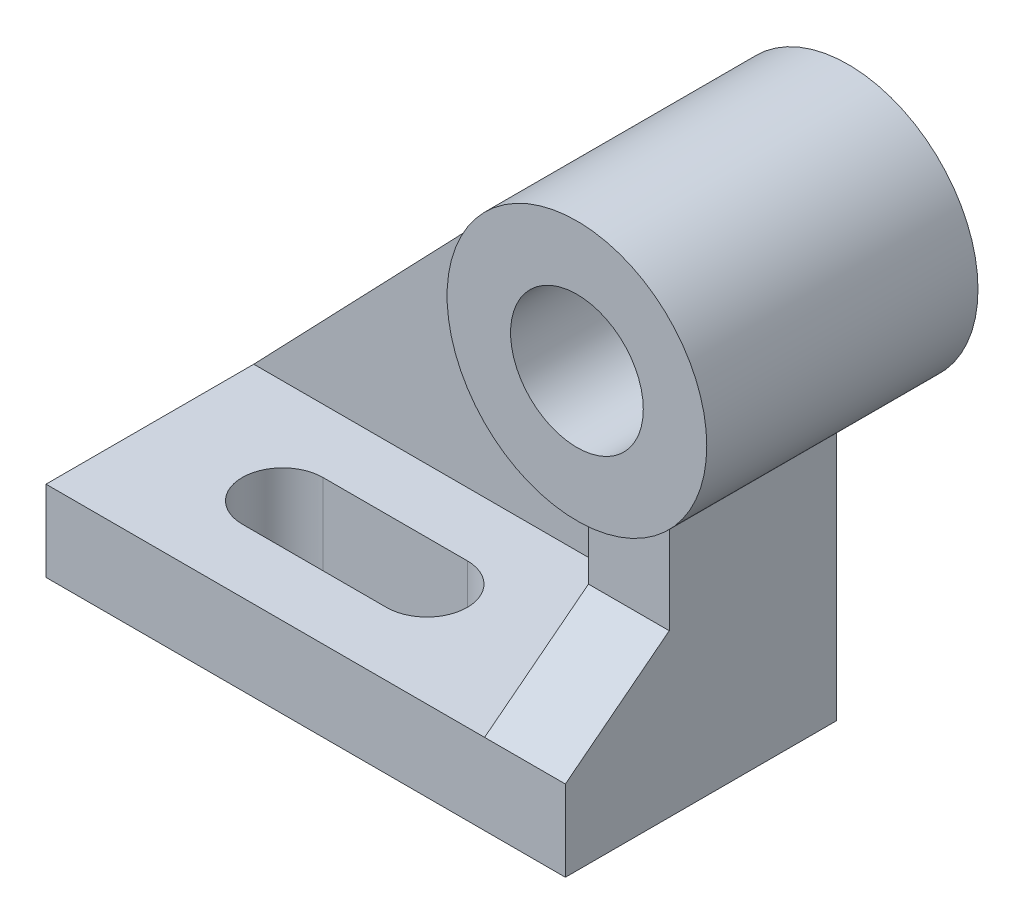
ISO-10303-21;
HEADER;
FILE_DESCRIPTION(('STEP AP214'),'2;1');
FILE_NAME('part.step','',(''),(''),'','','');
FILE_SCHEMA(('AUTOMOTIVE_DESIGN { 1 0 10303 214 1 1 1 1 }'));
ENDSEC;
DATA;
#1=APPLICATION_CONTEXT('core data for automotive mechanical design processes');
#2=APPLICATION_PROTOCOL_DEFINITION('international standard','automotive_design',2000,#1);
#3=PRODUCT_CONTEXT('',#1,'mechanical');
#4=PRODUCT('Part','Part','',(#3));
#5=PRODUCT_RELATED_PRODUCT_CATEGORY('part','',(#4));
#6=PRODUCT_DEFINITION_FORMATION('','',#4);
#7=PRODUCT_DEFINITION_CONTEXT('part definition',#1,'design');
#8=PRODUCT_DEFINITION('design','',#6,#7);
#9=PRODUCT_DEFINITION_SHAPE('','',#8);
#10=(LENGTH_UNIT() NAMED_UNIT(*) SI_UNIT(.MILLI.,.METRE.));
#11=(NAMED_UNIT(*) PLANE_ANGLE_UNIT() SI_UNIT($,.RADIAN.));
#12=(NAMED_UNIT(*) SI_UNIT($,.STERADIAN.) SOLID_ANGLE_UNIT());
#13=UNCERTAINTY_MEASURE_WITH_UNIT(LENGTH_MEASURE(1.E-05),#10,'distance_accuracy_value','');
#14=(GEOMETRIC_REPRESENTATION_CONTEXT(3) GLOBAL_UNCERTAINTY_ASSIGNED_CONTEXT((#13)) GLOBAL_UNIT_ASSIGNED_CONTEXT((#10,
#11,#12)) REPRESENTATION_CONTEXT('',''));
#15=CARTESIAN_POINT('',(0.,0.,0.));
#16=DIRECTION('',(0.,0.,1.));
#17=DIRECTION('',(1.,0.,0.));
#18=AXIS2_PLACEMENT_3D('',#15,#16,#17);
#19=CARTESIAN_POINT('',(0.,-54.,56.));
#20=DIRECTION('',(0.,-1.,0.));
#21=DIRECTION('',(1.,0.,0.));
#22=AXIS2_PLACEMENT_3D('',#19,#20,#21);
#23=PLANE('',#22);
#24=DIRECTION('',(1.,0.,0.));
#25=VECTOR('',#24,1.);
#26=CARTESIAN_POINT('',(0.,-54.,45.));
#27=LINE('',#26,#25);
#28=CARTESIAN_POINT('',(-60.,-54.,45.));
#29=VERTEX_POINT('',#28);
#30=CARTESIAN_POINT('',(-35.,-54.,45.));
#31=VERTEX_POINT('',#30);
#32=EDGE_CURVE('E144',#29,#31,#27,.T.);
#33=ORIENTED_EDGE('',*,*,#32,.F.);
#34=CARTESIAN_POINT('',(-60.,-54.,38.));
#35=DIRECTION('',(0.,-1.,0.));
#36=DIRECTION('',(1.,0.,0.));
#37=AXIS2_PLACEMENT_3D('',#34,#35,#36);
#38=CIRCLE('',#37,7.);
#39=CARTESIAN_POINT('',(-60.,-54.,31.));
#40=VERTEX_POINT('',#39);
#41=EDGE_CURVE('E137',#29,#40,#38,.T.);
#42=ORIENTED_EDGE('',*,*,#41,.T.);
#43=DIRECTION('',(1.,0.,0.));
#44=VECTOR('',#43,1.);
#45=CARTESIAN_POINT('',(0.,-54.,31.));
#46=LINE('',#45,#44);
#47=CARTESIAN_POINT('',(-35.,-54.,31.));
#48=VERTEX_POINT('',#47);
#49=EDGE_CURVE('E126',#40,#48,#46,.T.);
#50=ORIENTED_EDGE('',*,*,#49,.T.);
#51=CARTESIAN_POINT('',(-35.,-54.,38.));
#52=DIRECTION('',(0.,-1.,0.));
#53=DIRECTION('',(1.,0.,0.));
#54=AXIS2_PLACEMENT_3D('',#51,#52,#53);
#55=CIRCLE('',#54,7.);
#56=EDGE_CURVE('E131',#48,#31,#55,.T.);
#57=ORIENTED_EDGE('',*,*,#56,.T.);
#58=EDGE_LOOP('',(#33,#42,#50,#57));
#59=FACE_BOUND('',#58,.T.);
#60=DIRECTION('',(-1.,0.,0.));
#61=VECTOR('',#60,1.);
#62=CARTESIAN_POINT('',(0.,-54.,56.));
#63=LINE('',#62,#61);
#64=CARTESIAN_POINT('',(-6.99999999999999,-54.,56.));
#65=VERTEX_POINT('',#64);
#66=CARTESIAN_POINT('',(-83.,-54.,56.));
#67=VERTEX_POINT('',#66);
#68=EDGE_CURVE('E183',#65,#67,#63,.T.);
#69=ORIENTED_EDGE('',*,*,#68,.F.);
#70=DIRECTION('',(0.,0.,-1.));
#71=VECTOR('',#70,1.);
#72=CARTESIAN_POINT('',(-6.99999999999999,-54.,38.));
#73=LINE('',#72,#71);
#74=CARTESIAN_POINT('',(-6.99999999999999,-54.,20.));
#75=VERTEX_POINT('',#74);
#76=EDGE_CURVE('E168',#65,#75,#73,.T.);
#77=ORIENTED_EDGE('',*,*,#76,.T.);
#78=DIRECTION('',(1.,0.,0.));
#79=VECTOR('',#78,1.);
#80=CARTESIAN_POINT('',(-6.99999999999999,-54.,20.));
#81=LINE('',#80,#79);
#82=CARTESIAN_POINT('',(-83.,-54.,20.));
#83=VERTEX_POINT('',#82);
#84=EDGE_CURVE('E207',#83,#75,#81,.T.);
#85=ORIENTED_EDGE('',*,*,#84,.F.);
#86=DIRECTION('',(0.,0.,-1.));
#87=VECTOR('',#86,1.);
#88=CARTESIAN_POINT('',(-83.,-54.,56.));
#89=LINE('',#88,#87);
#90=EDGE_CURVE('E187',#67,#83,#89,.T.);
#91=ORIENTED_EDGE('',*,*,#90,.F.);
#92=EDGE_LOOP('',(#69,#77,#85,#91));
#93=FACE_BOUND('',#92,.T.);
#94=ADVANCED_FACE('F35',(#59,#93),#23,.F.);
#95=CARTESIAN_POINT('',(0.,0.,47.));
#96=DIRECTION('',(0.,0.,-1.));
#97=DIRECTION('',(-1.,0.,0.));
#98=AXIS2_PLACEMENT_3D('',#95,#96,#97);
#99=CYLINDRICAL_SURFACE('',#98,22.5);
#100=CARTESIAN_POINT('',(0.,0.,0.));
#101=DIRECTION('',(0.,0.,1.));
#102=DIRECTION('',(1.,0.,0.));
#103=AXIS2_PLACEMENT_3D('',#100,#101,#102);
#104=CIRCLE('',#103,22.5);
#105=CARTESIAN_POINT('',(22.5,0.,0.));
#106=VERTEX_POINT('',#105);
#107=EDGE_CURVE('E224',#106,#106,#104,.T.);
#108=ORIENTED_EDGE('',*,*,#107,.T.);
#109=EDGE_LOOP('',(#108));
#110=FACE_BOUND('',#109,.T.);
#111=CARTESIAN_POINT('',(0.,0.,47.));
#112=DIRECTION('',(0.,0.,1.));
#113=DIRECTION('',(1.,0.,0.));
#114=AXIS2_PLACEMENT_3D('',#111,#112,#113);
#115=CIRCLE('',#114,22.5);
#116=CARTESIAN_POINT('',(22.5,0.,47.));
#117=VERTEX_POINT('',#116);
#118=EDGE_CURVE('E227',#117,#117,#115,.T.);
#119=ORIENTED_EDGE('',*,*,#118,.F.);
#120=EDGE_LOOP('',(#119));
#121=FACE_BOUND('',#120,.T.);
#122=DIRECTION('',(0.,0.,-1.));
#123=VECTOR('',#122,1.);
#124=CARTESIAN_POINT('',(-6.99999999999999,-21.3834047803431,38.));
#125=LINE('',#124,#123);
#126=CARTESIAN_POINT('',(-6.99999999999999,-21.3834047803431,38.));
#127=VERTEX_POINT('',#126);
#128=CARTESIAN_POINT('',(-6.99999999999999,-21.3834047803431,20.));
#129=VERTEX_POINT('',#128);
#130=EDGE_CURVE('E170',#127,#129,#125,.T.);
#131=ORIENTED_EDGE('',*,*,#130,.F.);
#132=CARTESIAN_POINT('',(0.,0.,38.));
#133=DIRECTION('',(0.,0.,-1.));
#134=DIRECTION('',(-1.,0.,0.));
#135=AXIS2_PLACEMENT_3D('',#132,#133,#134);
#136=CIRCLE('',#135,22.5);
#137=CARTESIAN_POINT('',(7.00000000000001,-21.3834047803431,38.));
#138=VERTEX_POINT('',#137);
#139=EDGE_CURVE('E158',#138,#127,#136,.T.);
#140=ORIENTED_EDGE('',*,*,#139,.F.);
#141=DIRECTION('',(0.,0.,-1.));
#142=VECTOR('',#141,1.);
#143=CARTESIAN_POINT('',(7.00000000000001,-21.3834047803431,38.));
#144=LINE('',#143,#142);
#145=CARTESIAN_POINT('',(7.00000000000001,-21.3834047803431,9.));
#146=VERTEX_POINT('',#145);
#147=EDGE_CURVE('E165',#138,#146,#144,.T.);
#148=ORIENTED_EDGE('',*,*,#147,.T.);
#149=CARTESIAN_POINT('',(0.,0.,9.));
#150=DIRECTION('',(0.,0.,-1.));
#151=DIRECTION('',(1.,0.,0.));
#152=AXIS2_PLACEMENT_3D('',#149,#150,#151);
#153=CIRCLE('',#152,22.5);
#154=CARTESIAN_POINT('',(-16.2346998602256,15.5783349703475,9.));
#155=VERTEX_POINT('',#154);
#156=EDGE_CURVE('E211',#146,#155,#153,.T.);
#157=ORIENTED_EDGE('',*,*,#156,.T.);
#158=DIRECTION('',(0.,0.,-1.));
#159=VECTOR('',#158,1.);
#160=CARTESIAN_POINT('',(-16.2347042764132,15.5783303680918,20.));
#161=LINE('',#160,#159);
#162=CARTESIAN_POINT('',(-16.2346998602259,15.5783349703478,20.));
#163=VERTEX_POINT('',#162);
#164=EDGE_CURVE('E216',#163,#155,#161,.T.);
#165=ORIENTED_EDGE('',*,*,#164,.F.);
#166=CARTESIAN_POINT('',(0.,0.,20.));
#167=DIRECTION('',(0.,0.,-1.));
#168=DIRECTION('',(1.,0.,0.));
#169=AXIS2_PLACEMENT_3D('',#166,#167,#168);
#170=CIRCLE('',#169,22.5);
#171=EDGE_CURVE('E206',#129,#163,#170,.T.);
#172=ORIENTED_EDGE('',*,*,#171,.F.);
#173=EDGE_LOOP('',(#131,#140,#148,#157,#165,#172));
#174=FACE_BOUND('',#173,.T.);
#175=ADVANCED_FACE('F37',(#110,#121,#174),#99,.T.);
#176=CARTESIAN_POINT('',(0.,0.,47.));
#177=DIRECTION('',(0.,0.,1.));
#178=DIRECTION('',(1.,0.,0.));
#179=AXIS2_PLACEMENT_3D('',#176,#177,#178);
#180=PLANE('',#179);
#181=ORIENTED_EDGE('',*,*,#118,.T.);
#182=EDGE_LOOP('',(#181));
#183=FACE_BOUND('',#182,.T.);
#184=CARTESIAN_POINT('',(0.,0.,47.));
#185=DIRECTION('',(0.,0.,1.));
#186=DIRECTION('',(1.,0.,0.));
#187=AXIS2_PLACEMENT_3D('',#184,#185,#186);
#188=CIRCLE('',#187,11.5);
#189=CARTESIAN_POINT('',(11.5,0.,47.));
#190=VERTEX_POINT('',#189);
#191=EDGE_CURVE('E221',#190,#190,#188,.T.);
#192=ORIENTED_EDGE('',*,*,#191,.F.);
#193=EDGE_LOOP('',(#192));
#194=FACE_BOUND('',#193,.T.);
#195=ADVANCED_FACE('F274',(#183,#194),#180,.T.);
#196=CARTESIAN_POINT('',(0.,0.,0.));
#197=DIRECTION('',(0.,0.,1.));
#198=DIRECTION('',(1.,0.,0.));
#199=AXIS2_PLACEMENT_3D('',#196,#197,#198);
#200=PLANE('',#199);
#201=ORIENTED_EDGE('',*,*,#107,.F.);
#202=EDGE_LOOP('',(#201));
#203=FACE_BOUND('',#202,.T.);
#204=CARTESIAN_POINT('',(0.,0.,0.));
#205=DIRECTION('',(0.,0.,1.));
#206=DIRECTION('',(1.,0.,0.));
#207=AXIS2_PLACEMENT_3D('',#204,#205,#206);
#208=CIRCLE('',#207,11.5);
#209=CARTESIAN_POINT('',(11.5,0.,0.));
#210=VERTEX_POINT('',#209);
#211=EDGE_CURVE('E219',#210,#210,#208,.T.);
#212=ORIENTED_EDGE('',*,*,#211,.T.);
#213=EDGE_LOOP('',(#212));
#214=FACE_BOUND('',#213,.T.);
#215=ADVANCED_FACE('F305',(#203,#214),#200,.F.);
#216=CARTESIAN_POINT('',(0.,0.,47.));
#217=DIRECTION('',(0.,0.,-1.));
#218=DIRECTION('',(-1.,0.,0.));
#219=AXIS2_PLACEMENT_3D('',#216,#217,#218);
#220=CYLINDRICAL_SURFACE('',#219,11.5);
#221=ORIENTED_EDGE('',*,*,#191,.T.);
#222=EDGE_LOOP('',(#221));
#223=FACE_BOUND('',#222,.T.);
#224=ORIENTED_EDGE('',*,*,#211,.F.);
#225=EDGE_LOOP('',(#224));
#226=FACE_BOUND('',#225,.T.);
#227=ADVANCED_FACE('F301',(#223,#226),#220,.F.);
#228=CARTESIAN_POINT('',(-83.,-54.,20.));
#229=DIRECTION('',(0.721542216010055,-0.692370443126582,0.));
#230=DIRECTION('',(0.692370443126582,0.721542216010055,0.));
#231=AXIS2_PLACEMENT_3D('',#228,#229,#230);
#232=PLANE('',#231);
#233=DIRECTION('',(-0.692370443126582,-0.721542216010055,0.));
#234=VECTOR('',#233,1.);
#235=CARTESIAN_POINT('',(-83.,-54.,9.));
#236=LINE('',#235,#234);
#237=CARTESIAN_POINT('',(-83.,-54.,9.));
#238=VERTEX_POINT('',#237);
#239=EDGE_CURVE('E213',#155,#238,#236,.T.);
#240=ORIENTED_EDGE('',*,*,#239,.T.);
#241=DIRECTION('',(0.,0.,-1.));
#242=VECTOR('',#241,1.);
#243=CARTESIAN_POINT('',(-83.,-54.,20.));
#244=LINE('',#243,#242);
#245=EDGE_CURVE('E220',#83,#238,#244,.T.);
#246=ORIENTED_EDGE('',*,*,#245,.F.);
#247=DIRECTION('',(-0.692370443126582,-0.721542216010055,0.));
#248=VECTOR('',#247,1.);
#249=CARTESIAN_POINT('',(-83.,-54.,20.));
#250=LINE('',#249,#248);
#251=EDGE_CURVE('E210',#163,#83,#250,.T.);
#252=ORIENTED_EDGE('',*,*,#251,.F.);
#253=ORIENTED_EDGE('',*,*,#164,.T.);
#254=EDGE_LOOP('',(#240,#246,#252,#253));
#255=FACE_BOUND('',#254,.T.);
#256=ADVANCED_FACE('F294',(#255),#232,.F.);
#257=CARTESIAN_POINT('',(0.,0.,20.));
#258=DIRECTION('',(0.,0.,1.));
#259=DIRECTION('',(1.,0.,0.));
#260=AXIS2_PLACEMENT_3D('',#257,#258,#259);
#261=PLANE('',#260);
#262=ORIENTED_EDGE('',*,*,#84,.T.);
#263=DIRECTION('',(0.,1.,0.));
#264=VECTOR('',#263,1.);
#265=CARTESIAN_POINT('',(-6.99999999999999,-54.,20.));
#266=LINE('',#265,#264);
#267=EDGE_CURVE('E203',#75,#129,#266,.T.);
#268=ORIENTED_EDGE('',*,*,#267,.T.);
#269=ORIENTED_EDGE('',*,*,#171,.T.);
#270=ORIENTED_EDGE('',*,*,#251,.T.);
#271=EDGE_LOOP('',(#262,#268,#269,#270));
#272=FACE_BOUND('',#271,.T.);
#273=ADVANCED_FACE('F291',(#272),#261,.T.);
#274=CARTESIAN_POINT('',(0.,0.,9.));
#275=DIRECTION('',(0.,0.,1.));
#276=DIRECTION('',(1.,0.,0.));
#277=AXIS2_PLACEMENT_3D('',#274,#275,#276);
#278=PLANE('',#277);
#279=ORIENTED_EDGE('',*,*,#156,.F.);
#280=DIRECTION('',(0.,1.,0.));
#281=VECTOR('',#280,1.);
#282=CARTESIAN_POINT('',(7.00000000000001,0.,9.));
#283=LINE('',#282,#281);
#284=CARTESIAN_POINT('',(7.00000000000001,-68.,9.));
#285=VERTEX_POINT('',#284);
#286=EDGE_CURVE('E178',#285,#146,#283,.T.);
#287=ORIENTED_EDGE('',*,*,#286,.F.);
#288=DIRECTION('',(-1.,0.,0.));
#289=VECTOR('',#288,1.);
#290=CARTESIAN_POINT('',(0.,-68.,9.));
#291=LINE('',#290,#289);
#292=CARTESIAN_POINT('',(-83.,-68.,9.));
#293=VERTEX_POINT('',#292);
#294=EDGE_CURVE('E190',#285,#293,#291,.T.);
#295=ORIENTED_EDGE('',*,*,#294,.T.);
#296=DIRECTION('',(0.,1.,0.));
#297=VECTOR('',#296,1.);
#298=CARTESIAN_POINT('',(-83.,0.,9.));
#299=LINE('',#298,#297);
#300=EDGE_CURVE('E173',#293,#238,#299,.T.);
#301=ORIENTED_EDGE('',*,*,#300,.T.);
#302=ORIENTED_EDGE('',*,*,#239,.F.);
#303=EDGE_LOOP('',(#279,#287,#295,#301,#302));
#304=FACE_BOUND('',#303,.T.);
#305=ADVANCED_FACE('F289',(#304),#278,.F.);
#306=CARTESIAN_POINT('',(-83.,0.,56.));
#307=DIRECTION('',(-1.,0.,0.));
#308=DIRECTION('',(0.,0.,1.));
#309=AXIS2_PLACEMENT_3D('',#306,#307,#308);
#310=PLANE('',#309);
#311=ORIENTED_EDGE('',*,*,#300,.F.);
#312=DIRECTION('',(0.,0.,-1.));
#313=VECTOR('',#312,1.);
#314=CARTESIAN_POINT('',(-83.,-68.,56.));
#315=LINE('',#314,#313);
#316=CARTESIAN_POINT('',(-83.,-68.,56.));
#317=VERTEX_POINT('',#316);
#318=EDGE_CURVE('E202',#317,#293,#315,.T.);
#319=ORIENTED_EDGE('',*,*,#318,.F.);
#320=DIRECTION('',(0.,1.,0.));
#321=VECTOR('',#320,1.);
#322=CARTESIAN_POINT('',(-83.,0.,56.));
#323=LINE('',#322,#321);
#324=EDGE_CURVE('E174',#317,#67,#323,.T.);
#325=ORIENTED_EDGE('',*,*,#324,.T.);
#326=ORIENTED_EDGE('',*,*,#90,.T.);
#327=ORIENTED_EDGE('',*,*,#245,.T.);
#328=EDGE_LOOP('',(#311,#319,#325,#326,#327));
#329=FACE_BOUND('',#328,.T.);
#330=ADVANCED_FACE('F286',(#329),#310,.T.);
#331=CARTESIAN_POINT('',(0.,-68.,56.));
#332=DIRECTION('',(0.,-1.,0.));
#333=DIRECTION('',(1.,0.,0.));
#334=AXIS2_PLACEMENT_3D('',#331,#332,#333);
#335=PLANE('',#334);
#336=CARTESIAN_POINT('',(-60.,-68.,38.));
#337=DIRECTION('',(0.,-1.,0.));
#338=DIRECTION('',(1.,0.,0.));
#339=AXIS2_PLACEMENT_3D('',#336,#337,#338);
#340=CIRCLE('',#339,7.);
#341=CARTESIAN_POINT('',(-60.,-68.,45.));
#342=VERTEX_POINT('',#341);
#343=CARTESIAN_POINT('',(-60.,-68.,31.));
#344=VERTEX_POINT('',#343);
#345=EDGE_CURVE('E11',#342,#344,#340,.T.);
#346=ORIENTED_EDGE('',*,*,#345,.F.);
#347=DIRECTION('',(1.,0.,0.));
#348=VECTOR('',#347,1.);
#349=CARTESIAN_POINT('',(0.,-68.,45.));
#350=LINE('',#349,#348);
#351=CARTESIAN_POINT('',(-35.,-68.,45.));
#352=VERTEX_POINT('',#351);
#353=EDGE_CURVE('E43',#342,#352,#350,.T.);
#354=ORIENTED_EDGE('',*,*,#353,.T.);
#355=CARTESIAN_POINT('',(-35.,-68.,38.));
#356=DIRECTION('',(0.,-1.,0.));
#357=DIRECTION('',(1.,0.,0.));
#358=AXIS2_PLACEMENT_3D('',#355,#356,#357);
#359=CIRCLE('',#358,7.);
#360=CARTESIAN_POINT('',(-35.,-68.,31.));
#361=VERTEX_POINT('',#360);
#362=EDGE_CURVE('E245',#361,#352,#359,.T.);
#363=ORIENTED_EDGE('',*,*,#362,.F.);
#364=DIRECTION('',(1.,0.,0.));
#365=VECTOR('',#364,1.);
#366=CARTESIAN_POINT('',(0.,-68.,31.));
#367=LINE('',#366,#365);
#368=EDGE_CURVE('E230',#344,#361,#367,.T.);
#369=ORIENTED_EDGE('',*,*,#368,.F.);
#370=EDGE_LOOP('',(#346,#354,#363,#369));
#371=FACE_BOUND('',#370,.T.);
#372=ORIENTED_EDGE('',*,*,#294,.F.);
#373=DIRECTION('',(0.,0.,-1.));
#374=VECTOR('',#373,1.);
#375=CARTESIAN_POINT('',(7.00000000000001,-68.,56.));
#376=LINE('',#375,#374);
#377=CARTESIAN_POINT('',(7.00000000000001,-68.,56.));
#378=VERTEX_POINT('',#377);
#379=EDGE_CURVE('E197',#378,#285,#376,.T.);
#380=ORIENTED_EDGE('',*,*,#379,.F.);
#381=DIRECTION('',(-1.,0.,0.));
#382=VECTOR('',#381,1.);
#383=CARTESIAN_POINT('',(0.,-68.,56.));
#384=LINE('',#383,#382);
#385=EDGE_CURVE('E177',#378,#317,#384,.T.);
#386=ORIENTED_EDGE('',*,*,#385,.T.);
#387=ORIENTED_EDGE('',*,*,#318,.T.);
#388=EDGE_LOOP('',(#372,#380,#386,#387));
#389=FACE_BOUND('',#388,.T.);
#390=ADVANCED_FACE('F249',(#371,#389),#335,.T.);
#391=CARTESIAN_POINT('',(7.00000000000001,0.,56.));
#392=DIRECTION('',(-1.,0.,0.));
#393=DIRECTION('',(0.,0.,1.));
#394=AXIS2_PLACEMENT_3D('',#391,#392,#393);
#395=PLANE('',#394);
#396=ORIENTED_EDGE('',*,*,#286,.T.);
#397=ORIENTED_EDGE('',*,*,#147,.F.);
#398=DIRECTION('',(0.,1.,0.));
#399=VECTOR('',#398,1.);
#400=CARTESIAN_POINT('',(7.00000000000001,-54.,38.));
#401=LINE('',#400,#399);
#402=CARTESIAN_POINT('',(7.00000000000001,-40.,38.));
#403=VERTEX_POINT('',#402);
#404=EDGE_CURVE('E163',#403,#138,#401,.T.);
#405=ORIENTED_EDGE('',*,*,#404,.F.);
#406=DIRECTION('',(0.,-0.61394061351492,0.789352217376326));
#407=VECTOR('',#406,1.);
#408=CARTESIAN_POINT('',(7.00000000000001,-40.,38.));
#409=LINE('',#408,#407);
#410=CARTESIAN_POINT('',(7.00000000000001,-54.,56.));
#411=VERTEX_POINT('',#410);
#412=EDGE_CURVE('E145',#403,#411,#409,.T.);
#413=ORIENTED_EDGE('',*,*,#412,.T.);
#414=DIRECTION('',(0.,1.,0.));
#415=VECTOR('',#414,1.);
#416=CARTESIAN_POINT('',(7.00000000000001,0.,56.));
#417=LINE('',#416,#415);
#418=EDGE_CURVE('E181',#378,#411,#417,.T.);
#419=ORIENTED_EDGE('',*,*,#418,.F.);
#420=ORIENTED_EDGE('',*,*,#379,.T.);
#421=EDGE_LOOP('',(#396,#397,#405,#413,#419,#420));
#422=FACE_BOUND('',#421,.T.);
#423=ADVANCED_FACE('F280',(#422),#395,.F.);
#424=CARTESIAN_POINT('',(0.,0.,56.));
#425=DIRECTION('',(0.,0.,1.));
#426=DIRECTION('',(1.,0.,0.));
#427=AXIS2_PLACEMENT_3D('',#424,#425,#426);
#428=PLANE('',#427);
#429=ORIENTED_EDGE('',*,*,#324,.F.);
#430=ORIENTED_EDGE('',*,*,#385,.F.);
#431=ORIENTED_EDGE('',*,*,#418,.T.);
#432=EDGE_CURVE('E184',#411,#65,#63,.T.);
#433=ORIENTED_EDGE('',*,*,#432,.T.);
#434=ORIENTED_EDGE('',*,*,#68,.T.);
#435=EDGE_LOOP('',(#429,#430,#431,#433,#434));
#436=FACE_BOUND('',#435,.T.);
#437=ADVANCED_FACE('F278',(#436),#428,.T.);
#438=CARTESIAN_POINT('',(-6.99999999999999,-21.3834047803431,38.));
#439=DIRECTION('',(1.,0.,0.));
#440=DIRECTION('',(0.,0.,-1.));
#441=AXIS2_PLACEMENT_3D('',#438,#439,#440);
#442=PLANE('',#441);
#443=ORIENTED_EDGE('',*,*,#267,.F.);
#444=ORIENTED_EDGE('',*,*,#76,.F.);
#445=DIRECTION('',(0.,-0.61394061351492,0.789352217376326));
#446=VECTOR('',#445,1.);
#447=CARTESIAN_POINT('',(-6.99999999999999,-40.,38.));
#448=LINE('',#447,#446);
#449=CARTESIAN_POINT('',(-6.99999999999999,-40.,38.));
#450=VERTEX_POINT('',#449);
#451=EDGE_CURVE('E148',#450,#65,#448,.T.);
#452=ORIENTED_EDGE('',*,*,#451,.F.);
#453=DIRECTION('',(0.,-1.,0.));
#454=VECTOR('',#453,1.);
#455=CARTESIAN_POINT('',(-6.99999999999999,-21.3834047803431,38.));
#456=LINE('',#455,#454);
#457=EDGE_CURVE('E161',#127,#450,#456,.T.);
#458=ORIENTED_EDGE('',*,*,#457,.F.);
#459=ORIENTED_EDGE('',*,*,#130,.T.);
#460=EDGE_LOOP('',(#443,#444,#452,#458,#459));
#461=FACE_BOUND('',#460,.T.);
#462=ADVANCED_FACE('F326',(#461),#442,.F.);
#463=CARTESIAN_POINT('',(0.,0.,38.));
#464=DIRECTION('',(0.,0.,-1.));
#465=DIRECTION('',(-1.,0.,0.));
#466=AXIS2_PLACEMENT_3D('',#463,#464,#465);
#467=PLANE('',#466);
#468=ORIENTED_EDGE('',*,*,#457,.T.);
#469=DIRECTION('',(1.,0.,0.));
#470=VECTOR('',#469,1.);
#471=CARTESIAN_POINT('',(-6.99999999999999,-40.,38.));
#472=LINE('',#471,#470);
#473=EDGE_CURVE('E154',#450,#403,#472,.T.);
#474=ORIENTED_EDGE('',*,*,#473,.T.);
#475=ORIENTED_EDGE('',*,*,#404,.T.);
#476=ORIENTED_EDGE('',*,*,#139,.T.);
#477=EDGE_LOOP('',(#468,#474,#475,#476));
#478=FACE_BOUND('',#477,.T.);
#479=ADVANCED_FACE('F329',(#478),#467,.F.);
#480=CARTESIAN_POINT('',(-6.99999999999999,-40.,38.));
#481=DIRECTION('',(0.,0.789352217376326,0.61394061351492));
#482=DIRECTION('',(0.,-0.61394061351492,0.789352217376326));
#483=AXIS2_PLACEMENT_3D('',#480,#481,#482);
#484=PLANE('',#483);
#485=ORIENTED_EDGE('',*,*,#412,.F.);
#486=ORIENTED_EDGE('',*,*,#473,.F.);
#487=ORIENTED_EDGE('',*,*,#451,.T.);
#488=ORIENTED_EDGE('',*,*,#432,.F.);
#489=EDGE_LOOP('',(#485,#486,#487,#488));
#490=FACE_BOUND('',#489,.T.);
#491=ADVANCED_FACE('F345',(#490),#484,.T.);
#492=CARTESIAN_POINT('',(-60.,-29.9999999999999,38.));
#493=DIRECTION('',(0.,-1.,0.));
#494=DIRECTION('',(1.,0.,0.));
#495=AXIS2_PLACEMENT_3D('',#492,#493,#494);
#496=CYLINDRICAL_SURFACE('',#495,7.);
#497=DIRECTION('',(0.,-1.,0.));
#498=VECTOR('',#497,1.);
#499=CARTESIAN_POINT('',(-60.,-29.9999999999999,45.));
#500=LINE('',#499,#498);
#501=EDGE_CURVE('E132',#29,#342,#500,.T.);
#502=ORIENTED_EDGE('',*,*,#501,.T.);
#503=ORIENTED_EDGE('',*,*,#345,.T.);
#504=DIRECTION('',(0.,-1.,0.));
#505=VECTOR('',#504,1.);
#506=CARTESIAN_POINT('',(-60.,-29.9999999999999,31.));
#507=LINE('',#506,#505);
#508=EDGE_CURVE('E55',#40,#344,#507,.T.);
#509=ORIENTED_EDGE('',*,*,#508,.F.);
#510=ORIENTED_EDGE('',*,*,#41,.F.);
#511=EDGE_LOOP('',(#502,#503,#509,#510));
#512=FACE_BOUND('',#511,.T.);
#513=ADVANCED_FACE('F136',(#512),#496,.F.);
#514=CARTESIAN_POINT('',(-60.,-29.9999999999999,45.));
#515=DIRECTION('',(0.,0.,-1.));
#516=DIRECTION('',(-1.,0.,0.));
#517=AXIS2_PLACEMENT_3D('',#514,#515,#516);
#518=PLANE('',#517);
#519=ORIENTED_EDGE('',*,*,#32,.T.);
#520=DIRECTION('',(0.,-1.,0.));
#521=VECTOR('',#520,1.);
#522=CARTESIAN_POINT('',(-35.,-29.9999999999999,45.));
#523=LINE('',#522,#521);
#524=EDGE_CURVE('E255',#31,#352,#523,.T.);
#525=ORIENTED_EDGE('',*,*,#524,.T.);
#526=ORIENTED_EDGE('',*,*,#353,.F.);
#527=ORIENTED_EDGE('',*,*,#501,.F.);
#528=EDGE_LOOP('',(#519,#525,#526,#527));
#529=FACE_BOUND('',#528,.T.);
#530=ADVANCED_FACE('F253',(#529),#518,.T.);
#531=CARTESIAN_POINT('',(-35.,-29.9999999999999,38.));
#532=DIRECTION('',(0.,-1.,0.));
#533=DIRECTION('',(1.,0.,0.));
#534=AXIS2_PLACEMENT_3D('',#531,#532,#533);
#535=CYLINDRICAL_SURFACE('',#534,7.);
#536=DIRECTION('',(0.,-1.,0.));
#537=VECTOR('',#536,1.);
#538=CARTESIAN_POINT('',(-35.,-29.9999999999999,31.));
#539=LINE('',#538,#537);
#540=EDGE_CURVE('E50',#48,#361,#539,.T.);
#541=ORIENTED_EDGE('',*,*,#540,.T.);
#542=ORIENTED_EDGE('',*,*,#362,.T.);
#543=ORIENTED_EDGE('',*,*,#524,.F.);
#544=ORIENTED_EDGE('',*,*,#56,.F.);
#545=EDGE_LOOP('',(#541,#542,#543,#544));
#546=FACE_BOUND('',#545,.T.);
#547=ADVANCED_FACE('F260',(#546),#535,.F.);
#548=CARTESIAN_POINT('',(-60.,-29.9999999999999,31.));
#549=DIRECTION('',(0.,0.,-1.));
#550=DIRECTION('',(-1.,0.,0.));
#551=AXIS2_PLACEMENT_3D('',#548,#549,#550);
#552=PLANE('',#551);
#553=ORIENTED_EDGE('',*,*,#508,.T.);
#554=ORIENTED_EDGE('',*,*,#368,.T.);
#555=ORIENTED_EDGE('',*,*,#540,.F.);
#556=ORIENTED_EDGE('',*,*,#49,.F.);
#557=EDGE_LOOP('',(#553,#554,#555,#556));
#558=FACE_BOUND('',#557,.T.);
#559=ADVANCED_FACE('F127',(#558),#552,.F.);
#560=CLOSED_SHELL('',(#94,#175,#195,#215,#227,#256,#273,#305,#330,#390,#423,#437,#462,#479,#491,
#513,#530,#547,#559));
#561=MANIFOLD_SOLID_BREP('B2',#560);
#562=ADVANCED_BREP_SHAPE_REPRESENTATION('',(#18,#561),#14);
#563=SHAPE_DEFINITION_REPRESENTATION(#9,#562);
ENDSEC;
END-ISO-10303-21;
